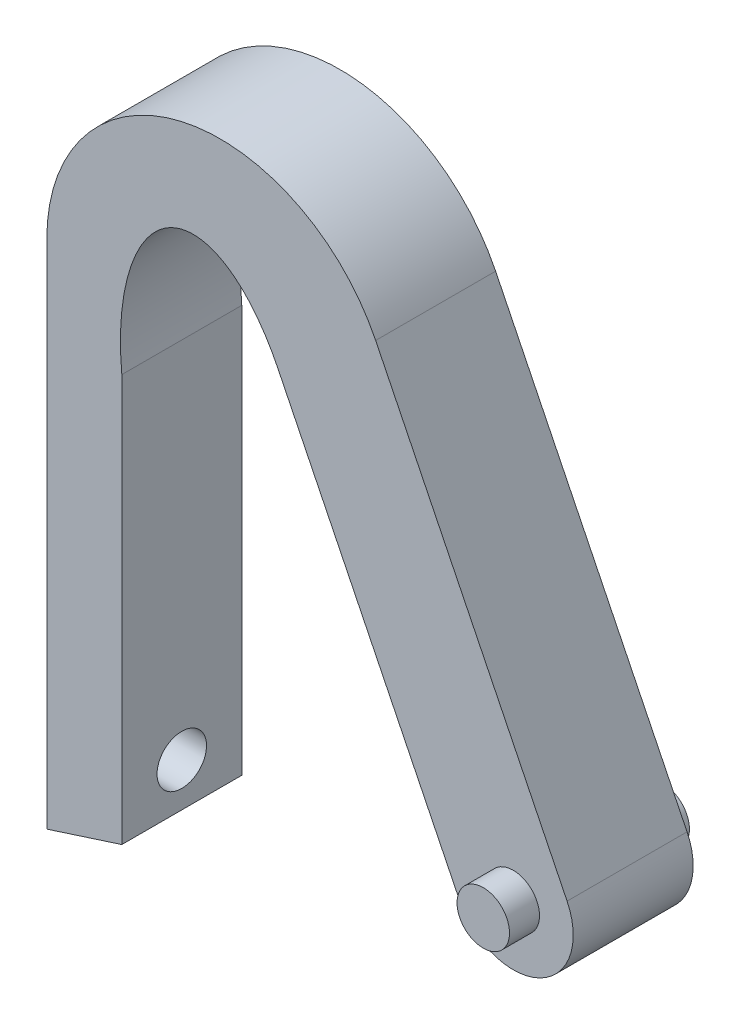
ISO-10303-21;
HEADER;
FILE_DESCRIPTION(('STEP AP214'),'2;1');
FILE_NAME('part.step','',(''),(''),'','','');
FILE_SCHEMA(('AUTOMOTIVE_DESIGN { 1 0 10303 214 1 1 1 1 }'));
ENDSEC;
DATA;
#1=APPLICATION_CONTEXT('core data for automotive mechanical design processes');
#2=APPLICATION_PROTOCOL_DEFINITION('international standard','automotive_design',2000,#1);
#3=PRODUCT_CONTEXT('',#1,'mechanical');
#4=PRODUCT('Part','Part','',(#3));
#5=PRODUCT_RELATED_PRODUCT_CATEGORY('part','',(#4));
#6=PRODUCT_DEFINITION_FORMATION('','',#4);
#7=PRODUCT_DEFINITION_CONTEXT('part definition',#1,'design');
#8=PRODUCT_DEFINITION('design','',#6,#7);
#9=PRODUCT_DEFINITION_SHAPE('','',#8);
#10=(LENGTH_UNIT() NAMED_UNIT(*) SI_UNIT(.MILLI.,.METRE.));
#11=(NAMED_UNIT(*) PLANE_ANGLE_UNIT() SI_UNIT($,.RADIAN.));
#12=(NAMED_UNIT(*) SI_UNIT($,.STERADIAN.) SOLID_ANGLE_UNIT());
#13=UNCERTAINTY_MEASURE_WITH_UNIT(LENGTH_MEASURE(1.E-05),#10,'distance_accuracy_value','');
#14=(GEOMETRIC_REPRESENTATION_CONTEXT(3) GLOBAL_UNCERTAINTY_ASSIGNED_CONTEXT((#13)) GLOBAL_UNIT_ASSIGNED_CONTEXT((#10,
#11,#12)) REPRESENTATION_CONTEXT('',''));
#15=CARTESIAN_POINT('',(0.,0.,0.));
#16=DIRECTION('',(0.,0.,1.));
#17=DIRECTION('',(1.,0.,0.));
#18=AXIS2_PLACEMENT_3D('',#15,#16,#17);
#19=CARTESIAN_POINT('',(-31.9984638997252,23.1925729579162,8.));
#20=DIRECTION('',(0.,0.,-1.));
#21=DIRECTION('',(-1.,0.,0.));
#22=AXIS2_PLACEMENT_3D('',#19,#20,#21);
#23=CYLINDRICAL_SURFACE('',#22,11.5555507757042);
#24=CARTESIAN_POINT('',(-31.9984638997252,23.1925729579162,0.));
#25=DIRECTION('',(0.,0.,1.));
#26=DIRECTION('',(1.,0.,0.));
#27=AXIS2_PLACEMENT_3D('',#24,#25,#26);
#28=CIRCLE('',#27,11.5555507757042);
#29=CARTESIAN_POINT('',(-21.6260864201182,28.2861511845089,0.));
#30=VERTEX_POINT('',#29);
#31=CARTESIAN_POINT('',(-43.5540146754293,23.1925729579162,0.));
#32=VERTEX_POINT('',#31);
#33=EDGE_CURVE('E130',#30,#32,#28,.T.);
#34=ORIENTED_EDGE('',*,*,#33,.T.);
#35=DIRECTION('',(0.,0.,-1.));
#36=VECTOR('',#35,1.);
#37=CARTESIAN_POINT('',(-43.5540146754293,23.1925729579162,8.));
#38=LINE('',#37,#36);
#39=CARTESIAN_POINT('',(-43.5540146754293,23.1925729579162,8.));
#40=VERTEX_POINT('',#39);
#41=EDGE_CURVE('E11',#40,#32,#38,.T.);
#42=ORIENTED_EDGE('',*,*,#41,.F.);
#43=CARTESIAN_POINT('',(-31.9984638997252,23.1925729579162,8.));
#44=DIRECTION('',(0.,0.,1.));
#45=DIRECTION('',(1.,0.,0.));
#46=AXIS2_PLACEMENT_3D('',#43,#44,#45);
#47=CIRCLE('',#46,11.5555507757042);
#48=CARTESIAN_POINT('',(-21.6260864201182,28.2861511845089,8.));
#49=VERTEX_POINT('',#48);
#50=EDGE_CURVE('E145',#49,#40,#47,.T.);
#51=ORIENTED_EDGE('',*,*,#50,.F.);
#52=DIRECTION('',(0.,0.,-1.));
#53=VECTOR('',#52,1.);
#54=CARTESIAN_POINT('',(-21.6260864201182,28.2861511845089,8.));
#55=LINE('',#54,#53);
#56=EDGE_CURVE('E126',#49,#30,#55,.T.);
#57=ORIENTED_EDGE('',*,*,#56,.T.);
#58=EDGE_LOOP('',(#34,#42,#51,#57));
#59=FACE_BOUND('',#58,.T.);
#60=ADVANCED_FACE('F34',(#59),#23,.T.);
#61=CARTESIAN_POINT('',(-43.5540146754293,23.1925729579162,8.));
#62=DIRECTION('',(1.,0.,0.));
#63=DIRECTION('',(0.,1.,0.));
#64=AXIS2_PLACEMENT_3D('',#61,#62,#63);
#65=PLANE('',#64);
#66=CARTESIAN_POINT('',(-43.5540146754293,-6.39948885446067,4.));
#67=DIRECTION('',(-1.,0.,0.));
#68=DIRECTION('',(0.,0.,1.));
#69=AXIS2_PLACEMENT_3D('',#66,#67,#68);
#70=CIRCLE('',#69,1.65);
#71=CARTESIAN_POINT('',(-43.5540146754293,-6.39948885446067,5.65));
#72=VERTEX_POINT('',#71);
#73=EDGE_CURVE('E195',#72,#72,#70,.T.);
#74=ORIENTED_EDGE('',*,*,#73,.F.);
#75=EDGE_LOOP('',(#74));
#76=FACE_BOUND('',#75,.T.);
#77=DIRECTION('',(0.,-1.,0.));
#78=VECTOR('',#77,1.);
#79=CARTESIAN_POINT('',(-43.5540146754293,23.1925729579162,0.));
#80=LINE('',#79,#78);
#81=CARTESIAN_POINT('',(-43.5540146754293,-10.8994888544607,0.));
#82=VERTEX_POINT('',#81);
#83=EDGE_CURVE('E133',#32,#82,#80,.T.);
#84=ORIENTED_EDGE('',*,*,#83,.T.);
#85=DIRECTION('',(0.,0.,-1.));
#86=VECTOR('',#85,1.);
#87=CARTESIAN_POINT('',(-43.5540146754293,-10.8994888544607,8.));
#88=LINE('',#87,#86);
#89=CARTESIAN_POINT('',(-43.5540146754293,-10.8994888544607,8.));
#90=VERTEX_POINT('',#89);
#91=EDGE_CURVE('E42',#90,#82,#88,.T.);
#92=ORIENTED_EDGE('',*,*,#91,.F.);
#93=DIRECTION('',(0.,-1.,0.));
#94=VECTOR('',#93,1.);
#95=CARTESIAN_POINT('',(-43.5540146754293,23.1925729579162,8.));
#96=LINE('',#95,#94);
#97=EDGE_CURVE('E93',#40,#90,#96,.T.);
#98=ORIENTED_EDGE('',*,*,#97,.F.);
#99=ORIENTED_EDGE('',*,*,#41,.T.);
#100=EDGE_LOOP('',(#84,#92,#98,#99));
#101=FACE_BOUND('',#100,.T.);
#102=ADVANCED_FACE('F185',(#76,#101),#65,.F.);
#103=CARTESIAN_POINT('',(-38.5540146754293,-9.29210470649914,8.));
#104=DIRECTION('',(-0.306050820494199,0.952015175968759,0.));
#105=DIRECTION('',(-0.952015175968759,-0.306050820494199,0.));
#106=AXIS2_PLACEMENT_3D('',#103,#104,#105);
#107=PLANE('',#106);
#108=DIRECTION('',(0.952015175968759,0.306050820494199,0.));
#109=VECTOR('',#108,1.);
#110=CARTESIAN_POINT('',(-38.5540146754293,-9.29210470649914,0.));
#111=LINE('',#110,#109);
#112=CARTESIAN_POINT('',(-38.5540146754293,-9.29210470649914,0.));
#113=VERTEX_POINT('',#112);
#114=EDGE_CURVE('E136',#82,#113,#111,.T.);
#115=ORIENTED_EDGE('',*,*,#114,.T.);
#116=DIRECTION('',(0.,0.,-1.));
#117=VECTOR('',#116,1.);
#118=CARTESIAN_POINT('',(-38.5540146754293,-9.29210470649914,8.));
#119=LINE('',#118,#117);
#120=CARTESIAN_POINT('',(-38.5540146754293,-9.29210470649914,8.));
#121=VERTEX_POINT('',#120);
#122=EDGE_CURVE('E152',#121,#113,#119,.T.);
#123=ORIENTED_EDGE('',*,*,#122,.F.);
#124=DIRECTION('',(0.952015175968759,0.306050820494199,0.));
#125=VECTOR('',#124,1.);
#126=CARTESIAN_POINT('',(-38.5540146754293,-9.29210470649914,8.));
#127=LINE('',#126,#125);
#128=EDGE_CURVE('E160',#90,#121,#127,.T.);
#129=ORIENTED_EDGE('',*,*,#128,.F.);
#130=ORIENTED_EDGE('',*,*,#91,.T.);
#131=EDGE_LOOP('',(#115,#123,#129,#130));
#132=FACE_BOUND('',#131,.T.);
#133=ADVANCED_FACE('F158',(#132),#107,.F.);
#134=CARTESIAN_POINT('',(-38.5540146754293,17.849905122811,8.));
#135=DIRECTION('',(-1.,0.,0.));
#136=DIRECTION('',(0.,-1.,0.));
#137=AXIS2_PLACEMENT_3D('',#134,#135,#136);
#138=PLANE('',#137);
#139=CARTESIAN_POINT('',(-38.5540146754293,-6.39948885446067,4.));
#140=DIRECTION('',(-1.,0.,0.));
#141=DIRECTION('',(0.,-1.,0.));
#142=AXIS2_PLACEMENT_3D('',#139,#140,#141);
#143=CIRCLE('',#142,1.65);
#144=CARTESIAN_POINT('',(-38.5540146754293,-8.04948885446067,4.));
#145=VERTEX_POINT('',#144);
#146=EDGE_CURVE('E235',#145,#145,#143,.T.);
#147=ORIENTED_EDGE('',*,*,#146,.T.);
#148=EDGE_LOOP('',(#147));
#149=FACE_BOUND('',#148,.T.);
#150=DIRECTION('',(0.,1.,0.));
#151=VECTOR('',#150,1.);
#152=CARTESIAN_POINT('',(-38.5540146754293,17.849905122811,0.));
#153=LINE('',#152,#151);
#154=CARTESIAN_POINT('',(-38.5540146754293,17.849905122811,0.));
#155=VERTEX_POINT('',#154);
#156=EDGE_CURVE('E138',#113,#155,#153,.T.);
#157=ORIENTED_EDGE('',*,*,#156,.T.);
#158=DIRECTION('',(0.,0.,-1.));
#159=VECTOR('',#158,1.);
#160=CARTESIAN_POINT('',(-38.5540146754293,17.849905122811,8.));
#161=LINE('',#160,#159);
#162=CARTESIAN_POINT('',(-38.5540146754293,17.849905122811,8.));
#163=VERTEX_POINT('',#162);
#164=EDGE_CURVE('E149',#163,#155,#161,.T.);
#165=ORIENTED_EDGE('',*,*,#164,.F.);
#166=DIRECTION('',(0.,1.,0.));
#167=VECTOR('',#166,1.);
#168=CARTESIAN_POINT('',(-38.5540146754293,17.849905122811,8.));
#169=LINE('',#168,#167);
#170=EDGE_CURVE('E172',#121,#163,#169,.T.);
#171=ORIENTED_EDGE('',*,*,#170,.F.);
#172=ORIENTED_EDGE('',*,*,#122,.T.);
#173=EDGE_LOOP('',(#157,#165,#171,#172));
#174=FACE_BOUND('',#173,.T.);
#175=ADVANCED_FACE('F168',(#149,#174),#138,.F.);
#176=CARTESIAN_POINT('',(-32.4427465408274,17.3339636825348,8.));
#177=DIRECTION('',(0.,0.,-1.));
#178=DIRECTION('',(-0.172486215660984,0.985011931606391,0.));
#179=AXIS2_PLACEMENT_3D('',#176,#177,#178);
#180=ELLIPSE('',#179,11.1188373973429,5.99010630982257);
#181=DIRECTION('',(0.,0.,-1.));
#182=VECTOR('',#181,1.);
#183=SURFACE_OF_LINEAR_EXTRUSION('',#180,#182);
#184=CARTESIAN_POINT('',(-32.4427465408274,17.3339636825348,0.));
#185=DIRECTION('',(0.,0.,-1.));
#186=DIRECTION('',(-0.172486215660984,0.985011931606391,0.));
#187=AXIS2_PLACEMENT_3D('',#184,#185,#186);
#188=ELLIPSE('',#187,11.1188373973429,5.99010630982257);
#189=CARTESIAN_POINT('',(-28.1624422927712,23.4473414800158,0.));
#190=VERTEX_POINT('',#189);
#191=EDGE_CURVE('E140',#155,#190,#188,.T.);
#192=ORIENTED_EDGE('',*,*,#191,.T.);
#193=DIRECTION('',(0.,0.,-1.));
#194=VECTOR('',#193,1.);
#195=CARTESIAN_POINT('',(-28.1624422927712,23.4473414800158,8.));
#196=LINE('',#195,#194);
#197=CARTESIAN_POINT('',(-28.1624422927712,23.4473414800158,8.));
#198=VERTEX_POINT('',#197);
#199=EDGE_CURVE('E121',#198,#190,#196,.T.);
#200=ORIENTED_EDGE('',*,*,#199,.F.);
#201=EDGE_CURVE('E112',#163,#198,#180,.T.);
#202=ORIENTED_EDGE('',*,*,#201,.F.);
#203=ORIENTED_EDGE('',*,*,#164,.T.);
#204=EDGE_LOOP('',(#192,#200,#202,#203));
#205=FACE_BOUND('',#204,.T.);
#206=ADVANCED_FACE('F171',(#205),#183,.F.);
#207=CARTESIAN_POINT('',(-28.1624422927712,23.4473414800158,8.));
#208=DIRECTION('',(0.897609960869641,0.440790605784199,0.));
#209=DIRECTION('',(-0.440790605784199,0.897609960869641,0.));
#210=AXIS2_PLACEMENT_3D('',#207,#208,#209);
#211=PLANE('',#210);
#212=DIRECTION('',(0.440790605784199,-0.897609960869641,0.));
#213=VECTOR('',#212,1.);
#214=CARTESIAN_POINT('',(-28.1624422927712,23.4473414800158,0.));
#215=LINE('',#214,#213);
#216=CARTESIAN_POINT('',(-16.0407006337057,-1.23693244389929,0.));
#217=VERTEX_POINT('',#216);
#218=EDGE_CURVE('E120',#190,#217,#215,.T.);
#219=ORIENTED_EDGE('',*,*,#218,.T.);
#220=DIRECTION('',(0.,0.,-1.));
#221=VECTOR('',#220,1.);
#222=CARTESIAN_POINT('',(-16.0407006337057,-1.23693244389929,8.));
#223=LINE('',#222,#221);
#224=CARTESIAN_POINT('',(-16.0407006337057,-1.23693244389929,8.));
#225=VERTEX_POINT('',#224);
#226=EDGE_CURVE('E117',#225,#217,#223,.T.);
#227=ORIENTED_EDGE('',*,*,#226,.F.);
#228=DIRECTION('',(0.440790605784199,-0.897609960869641,0.));
#229=VECTOR('',#228,1.);
#230=CARTESIAN_POINT('',(-28.1624422927712,23.4473414800158,8.));
#231=LINE('',#230,#229);
#232=EDGE_CURVE('E106',#198,#225,#231,.T.);
#233=ORIENTED_EDGE('',*,*,#232,.F.);
#234=ORIENTED_EDGE('',*,*,#199,.T.);
#235=EDGE_LOOP('',(#219,#227,#233,#234));
#236=FACE_BOUND('',#235,.T.);
#237=ADVANCED_FACE('F118',(#236),#211,.F.);
#238=CARTESIAN_POINT('',(-12.4502607902271,0.526229979237503,8.));
#239=DIRECTION('',(0.,0.,-1.));
#240=DIRECTION('',(-1.,0.,0.));
#241=AXIS2_PLACEMENT_3D('',#238,#239,#240);
#242=CYLINDRICAL_SURFACE('',#241,4.);
#243=CARTESIAN_POINT('',(-12.4502607902271,0.526229979237503,0.));
#244=DIRECTION('',(0.,0.,1.));
#245=DIRECTION('',(1.,0.,0.));
#246=AXIS2_PLACEMENT_3D('',#243,#244,#245);
#247=CIRCLE('',#246,4.);
#248=CARTESIAN_POINT('',(-8.85982094674856,2.2893924023743,0.));
#249=VERTEX_POINT('',#248);
#250=EDGE_CURVE('E79',#217,#249,#247,.T.);
#251=ORIENTED_EDGE('',*,*,#250,.T.);
#252=DIRECTION('',(0.,0.,-1.));
#253=VECTOR('',#252,1.);
#254=CARTESIAN_POINT('',(-8.85982094674856,2.2893924023743,8.));
#255=LINE('',#254,#253);
#256=CARTESIAN_POINT('',(-8.85982094674856,2.2893924023743,8.));
#257=VERTEX_POINT('',#256);
#258=EDGE_CURVE('E122',#257,#249,#255,.T.);
#259=ORIENTED_EDGE('',*,*,#258,.F.);
#260=CARTESIAN_POINT('',(-12.4502607902271,0.526229979237503,8.));
#261=DIRECTION('',(0.,0.,1.));
#262=DIRECTION('',(1.,0.,0.));
#263=AXIS2_PLACEMENT_3D('',#260,#261,#262);
#264=CIRCLE('',#263,4.);
#265=EDGE_CURVE('E110',#225,#257,#264,.T.);
#266=ORIENTED_EDGE('',*,*,#265,.F.);
#267=ORIENTED_EDGE('',*,*,#226,.T.);
#268=EDGE_LOOP('',(#251,#259,#266,#267));
#269=FACE_BOUND('',#268,.T.);
#270=ADVANCED_FACE('F124',(#269),#242,.T.);
#271=CARTESIAN_POINT('',(-21.6260864201182,28.2861511845089,8.));
#272=DIRECTION('',(-0.897609960869641,-0.440790605784199,0.));
#273=DIRECTION('',(0.440790605784199,-0.897609960869641,0.));
#274=AXIS2_PLACEMENT_3D('',#271,#272,#273);
#275=PLANE('',#274);
#276=DIRECTION('',(-0.440790605784199,0.897609960869641,0.));
#277=VECTOR('',#276,1.);
#278=CARTESIAN_POINT('',(-21.6260864201182,28.2861511845089,0.));
#279=LINE('',#278,#277);
#280=EDGE_CURVE('E85',#249,#30,#279,.T.);
#281=ORIENTED_EDGE('',*,*,#280,.T.);
#282=ORIENTED_EDGE('',*,*,#56,.F.);
#283=DIRECTION('',(-0.440790605784199,0.897609960869641,0.));
#284=VECTOR('',#283,1.);
#285=CARTESIAN_POINT('',(-21.6260864201182,28.2861511845089,8.));
#286=LINE('',#285,#284);
#287=EDGE_CURVE('E50',#257,#49,#286,.T.);
#288=ORIENTED_EDGE('',*,*,#287,.F.);
#289=ORIENTED_EDGE('',*,*,#258,.T.);
#290=EDGE_LOOP('',(#281,#282,#288,#289));
#291=FACE_BOUND('',#290,.T.);
#292=ADVANCED_FACE('F198',(#291),#275,.F.);
#293=CARTESIAN_POINT('',(-32.4427465408274,17.3339636825348,8.));
#294=DIRECTION('',(0.,0.,1.));
#295=DIRECTION('',(1.,0.,0.));
#296=AXIS2_PLACEMENT_3D('',#293,#294,#295);
#297=PLANE('',#296);
#298=CARTESIAN_POINT('',(-12.4502607902271,0.526229979237503,8.));
#299=DIRECTION('',(0.,0.,1.));
#300=DIRECTION('',(1.,0.,0.));
#301=AXIS2_PLACEMENT_3D('',#298,#299,#300);
#302=CIRCLE('',#301,1.75);
#303=CARTESIAN_POINT('',(-10.7002607902271,0.526229979237503,8.));
#304=VERTEX_POINT('',#303);
#305=EDGE_CURVE('E244',#304,#304,#302,.T.);
#306=ORIENTED_EDGE('',*,*,#305,.F.);
#307=EDGE_LOOP('',(#306));
#308=FACE_BOUND('',#307,.T.);
#309=ORIENTED_EDGE('',*,*,#50,.T.);
#310=ORIENTED_EDGE('',*,*,#97,.T.);
#311=ORIENTED_EDGE('',*,*,#128,.T.);
#312=ORIENTED_EDGE('',*,*,#170,.T.);
#313=ORIENTED_EDGE('',*,*,#201,.T.);
#314=ORIENTED_EDGE('',*,*,#232,.T.);
#315=ORIENTED_EDGE('',*,*,#265,.T.);
#316=ORIENTED_EDGE('',*,*,#287,.T.);
#317=EDGE_LOOP('',(#309,#310,#311,#312,#313,#314,#315,#316));
#318=FACE_BOUND('',#317,.T.);
#319=ADVANCED_FACE('F108',(#308,#318),#297,.T.);
#320=CARTESIAN_POINT('',(-32.4427465408274,17.3339636825348,0.));
#321=DIRECTION('',(0.,0.,1.));
#322=DIRECTION('',(1.,0.,0.));
#323=AXIS2_PLACEMENT_3D('',#320,#321,#322);
#324=PLANE('',#323);
#325=CARTESIAN_POINT('',(-12.4502607902271,0.526229979237503,0.));
#326=DIRECTION('',(0.,0.,1.));
#327=DIRECTION('',(1.,0.,0.));
#328=AXIS2_PLACEMENT_3D('',#325,#326,#327);
#329=CIRCLE('',#328,1.75);
#330=CARTESIAN_POINT('',(-10.7002607902271,0.526229979237503,0.));
#331=VERTEX_POINT('',#330);
#332=EDGE_CURVE('E236',#331,#331,#329,.T.);
#333=ORIENTED_EDGE('',*,*,#332,.T.);
#334=EDGE_LOOP('',(#333));
#335=FACE_BOUND('',#334,.T.);
#336=ORIENTED_EDGE('',*,*,#33,.F.);
#337=ORIENTED_EDGE('',*,*,#280,.F.);
#338=ORIENTED_EDGE('',*,*,#250,.F.);
#339=ORIENTED_EDGE('',*,*,#218,.F.);
#340=ORIENTED_EDGE('',*,*,#191,.F.);
#341=ORIENTED_EDGE('',*,*,#156,.F.);
#342=ORIENTED_EDGE('',*,*,#114,.F.);
#343=ORIENTED_EDGE('',*,*,#83,.F.);
#344=EDGE_LOOP('',(#336,#337,#338,#339,#340,#341,#342,#343));
#345=FACE_BOUND('',#344,.T.);
#346=ADVANCED_FACE('F164',(#335,#345),#324,.F.);
#347=CARTESIAN_POINT('',(-12.4502607902271,0.526229979237503,10.));
#348=DIRECTION('',(0.,0.,-1.));
#349=DIRECTION('',(-1.,0.,0.));
#350=AXIS2_PLACEMENT_3D('',#347,#348,#349);
#351=CYLINDRICAL_SURFACE('',#350,1.75);
#352=CARTESIAN_POINT('',(-12.4502607902271,0.526229979237503,10.));
#353=DIRECTION('',(0.,0.,1.));
#354=DIRECTION('',(1.,0.,0.));
#355=AXIS2_PLACEMENT_3D('',#352,#353,#354);
#356=CIRCLE('',#355,1.75);
#357=CARTESIAN_POINT('',(-10.7002607902271,0.526229979237503,10.));
#358=VERTEX_POINT('',#357);
#359=EDGE_CURVE('E134',#358,#358,#356,.T.);
#360=ORIENTED_EDGE('',*,*,#359,.F.);
#361=EDGE_LOOP('',(#360));
#362=FACE_BOUND('',#361,.T.);
#363=ORIENTED_EDGE('',*,*,#305,.T.);
#364=EDGE_LOOP('',(#363));
#365=FACE_BOUND('',#364,.T.);
#366=ADVANCED_FACE('F209',(#362,#365),#351,.T.);
#367=CARTESIAN_POINT('',(-12.4502607902271,0.526229979237503,10.));
#368=DIRECTION('',(0.,0.,1.));
#369=DIRECTION('',(1.,0.,0.));
#370=AXIS2_PLACEMENT_3D('',#367,#368,#369);
#371=PLANE('',#370);
#372=ORIENTED_EDGE('',*,*,#359,.T.);
#373=EDGE_LOOP('',(#372));
#374=FACE_BOUND('',#373,.T.);
#375=ADVANCED_FACE('F214',(#374),#371,.T.);
#376=CARTESIAN_POINT('',(-12.4502607902271,0.526229979237503,-2.));
#377=DIRECTION('',(0.,0.,1.));
#378=DIRECTION('',(1.,0.,0.));
#379=AXIS2_PLACEMENT_3D('',#376,#377,#378);
#380=CYLINDRICAL_SURFACE('',#379,1.75);
#381=CARTESIAN_POINT('',(-12.4502607902271,0.526229979237503,-2.));
#382=DIRECTION('',(0.,0.,1.));
#383=DIRECTION('',(1.,0.,0.));
#384=AXIS2_PLACEMENT_3D('',#381,#382,#383);
#385=CIRCLE('',#384,1.75);
#386=CARTESIAN_POINT('',(-10.7002607902271,0.526229979237503,-2.));
#387=VERTEX_POINT('',#386);
#388=EDGE_CURVE('E239',#387,#387,#385,.T.);
#389=ORIENTED_EDGE('',*,*,#388,.T.);
#390=EDGE_LOOP('',(#389));
#391=FACE_BOUND('',#390,.T.);
#392=ORIENTED_EDGE('',*,*,#332,.F.);
#393=EDGE_LOOP('',(#392));
#394=FACE_BOUND('',#393,.T.);
#395=ADVANCED_FACE('F218',(#391,#394),#380,.T.);
#396=CARTESIAN_POINT('',(-12.4502607902271,0.526229979237503,-2.));
#397=DIRECTION('',(0.,0.,-1.));
#398=DIRECTION('',(1.,0.,0.));
#399=AXIS2_PLACEMENT_3D('',#396,#397,#398);
#400=PLANE('',#399);
#401=ORIENTED_EDGE('',*,*,#388,.F.);
#402=EDGE_LOOP('',(#401));
#403=FACE_BOUND('',#402,.T.);
#404=ADVANCED_FACE('F222',(#403),#400,.T.);
#405=CARTESIAN_POINT('',(-43.5540146754293,-6.39948885446067,4.));
#406=DIRECTION('',(-1.,0.,0.));
#407=DIRECTION('',(0.,0.,1.));
#408=AXIS2_PLACEMENT_3D('',#405,#406,#407);
#409=CYLINDRICAL_SURFACE('',#408,1.65);
#410=ORIENTED_EDGE('',*,*,#73,.T.);
#411=EDGE_LOOP('',(#410));
#412=FACE_BOUND('',#411,.T.);
#413=ORIENTED_EDGE('',*,*,#146,.F.);
#414=EDGE_LOOP('',(#413));
#415=FACE_BOUND('',#414,.T.);
#416=ADVANCED_FACE('F226',(#412,#415),#409,.F.);
#417=CLOSED_SHELL('',(#60,#102,#133,#175,#206,#237,#270,#292,#319,#346,#366,#375,#395,#404,#416));
#418=MANIFOLD_SOLID_BREP('B2',#417);
#419=ADVANCED_BREP_SHAPE_REPRESENTATION('',(#18,#418),#14);
#420=SHAPE_DEFINITION_REPRESENTATION(#9,#419);
ENDSEC;
END-ISO-10303-21;
